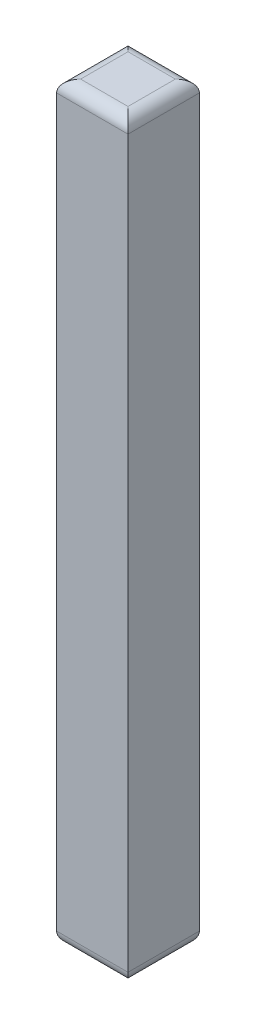
ISO-10303-21;
HEADER;
FILE_DESCRIPTION(('STEP AP214'),'2;1');
FILE_NAME('part.step','',(''),(''),'','','');
FILE_SCHEMA(('AUTOMOTIVE_DESIGN { 1 0 10303 214 1 1 1 1 }'));
ENDSEC;
DATA;
#1=APPLICATION_CONTEXT('core data for automotive mechanical design processes');
#2=APPLICATION_PROTOCOL_DEFINITION('international standard','automotive_design',2000,#1);
#3=PRODUCT_CONTEXT('',#1,'mechanical');
#4=PRODUCT('Part','Part','',(#3));
#5=PRODUCT_RELATED_PRODUCT_CATEGORY('part','',(#4));
#6=PRODUCT_DEFINITION_FORMATION('','',#4);
#7=PRODUCT_DEFINITION_CONTEXT('part definition',#1,'design');
#8=PRODUCT_DEFINITION('design','',#6,#7);
#9=PRODUCT_DEFINITION_SHAPE('','',#8);
#10=(LENGTH_UNIT() NAMED_UNIT(*) SI_UNIT(.MILLI.,.METRE.));
#11=(NAMED_UNIT(*) PLANE_ANGLE_UNIT() SI_UNIT($,.RADIAN.));
#12=(NAMED_UNIT(*) SI_UNIT($,.STERADIAN.) SOLID_ANGLE_UNIT());
#13=UNCERTAINTY_MEASURE_WITH_UNIT(LENGTH_MEASURE(1.E-05),#10,'distance_accuracy_value','');
#14=(GEOMETRIC_REPRESENTATION_CONTEXT(3) GLOBAL_UNCERTAINTY_ASSIGNED_CONTEXT((#13)) GLOBAL_UNIT_ASSIGNED_CONTEXT((#10,
#11,#12)) REPRESENTATION_CONTEXT('',''));
#15=CARTESIAN_POINT('',(0.,0.,0.));
#16=DIRECTION('',(0.,0.,1.));
#17=DIRECTION('',(1.,0.,0.));
#18=AXIS2_PLACEMENT_3D('',#15,#16,#17);
#19=CARTESIAN_POINT('',(0.,31.75,0.));
#20=DIRECTION('',(1.,0.,0.));
#21=DIRECTION('',(0.,0.,-1.));
#22=AXIS2_PLACEMENT_3D('',#19,#20,#21);
#23=PLANE('',#22);
#24=DIRECTION('',(0.,-1.,0.));
#25=VECTOR('',#24,1.);
#26=CARTESIAN_POINT('',(0.,31.75,0.));
#27=LINE('',#26,#25);
#28=CARTESIAN_POINT('',(0.,31.242,0.));
#29=VERTEX_POINT('',#28);
#30=CARTESIAN_POINT('',(0.,0.508000000000002,0.));
#31=VERTEX_POINT('',#30);
#32=EDGE_CURVE('E118',#29,#31,#27,.T.);
#33=ORIENTED_EDGE('',*,*,#32,.F.);
#34=DIRECTION('',(0.,0.,1.));
#35=VECTOR('',#34,1.);
#36=CARTESIAN_POINT('',(0.,31.242,0.));
#37=LINE('',#36,#35);
#38=CARTESIAN_POINT('',(0.,31.242,-3.0226));
#39=VERTEX_POINT('',#38);
#40=EDGE_CURVE('E142',#29,#39,#37,.F.);
#41=ORIENTED_EDGE('',*,*,#40,.T.);
#42=DIRECTION('',(0.,-1.,0.));
#43=VECTOR('',#42,1.);
#44=CARTESIAN_POINT('',(0.,31.75,-3.0226));
#45=LINE('',#44,#43);
#46=CARTESIAN_POINT('',(0.,0.508000000000002,-3.0226));
#47=VERTEX_POINT('',#46);
#48=EDGE_CURVE('E153',#39,#47,#45,.T.);
#49=ORIENTED_EDGE('',*,*,#48,.T.);
#50=DIRECTION('',(0.,0.,1.));
#51=VECTOR('',#50,1.);
#52=CARTESIAN_POINT('',(0.,0.508000000000002,0.));
#53=LINE('',#52,#51);
#54=EDGE_CURVE('E140',#47,#31,#53,.T.);
#55=ORIENTED_EDGE('',*,*,#54,.T.);
#56=EDGE_LOOP('',(#33,#41,#49,#55));
#57=FACE_BOUND('',#56,.T.);
#58=ADVANCED_FACE('F33',(#57),#23,.F.);
#59=CARTESIAN_POINT('',(0.,31.75,0.));
#60=DIRECTION('',(0.,0.,-1.));
#61=DIRECTION('',(-1.,0.,0.));
#62=AXIS2_PLACEMENT_3D('',#59,#60,#61);
#63=PLANE('',#62);
#64=DIRECTION('',(0.,-1.,0.));
#65=VECTOR('',#64,1.);
#66=CARTESIAN_POINT('',(3.0226,31.75,0.));
#67=LINE('',#66,#65);
#68=CARTESIAN_POINT('',(3.0226,31.242,0.));
#69=VERTEX_POINT('',#68);
#70=CARTESIAN_POINT('',(3.0226,0.508000000000002,0.));
#71=VERTEX_POINT('',#70);
#72=EDGE_CURVE('E280',#69,#71,#67,.T.);
#73=ORIENTED_EDGE('',*,*,#72,.F.);
#74=DIRECTION('',(1.,0.,0.));
#75=VECTOR('',#74,1.);
#76=CARTESIAN_POINT('',(0.,31.242,0.));
#77=LINE('',#76,#75);
#78=EDGE_CURVE('E138',#69,#29,#77,.F.);
#79=ORIENTED_EDGE('',*,*,#78,.T.);
#80=ORIENTED_EDGE('',*,*,#32,.T.);
#81=DIRECTION('',(1.,0.,0.));
#82=VECTOR('',#81,1.);
#83=CARTESIAN_POINT('',(3.0226,0.508000000000002,0.));
#84=LINE('',#83,#82);
#85=EDGE_CURVE('E135',#31,#71,#84,.T.);
#86=ORIENTED_EDGE('',*,*,#85,.T.);
#87=EDGE_LOOP('',(#73,#79,#80,#86));
#88=FACE_BOUND('',#87,.T.);
#89=ADVANCED_FACE('F190',(#88),#63,.F.);
#90=CARTESIAN_POINT('',(3.0226,31.75,0.));
#91=DIRECTION('',(-1.,0.,0.));
#92=DIRECTION('',(0.,0.,1.));
#93=AXIS2_PLACEMENT_3D('',#90,#91,#92);
#94=PLANE('',#93);
#95=DIRECTION('',(0.,-1.,0.));
#96=VECTOR('',#95,1.);
#97=CARTESIAN_POINT('',(3.0226,31.75,-3.0226));
#98=LINE('',#97,#96);
#99=CARTESIAN_POINT('',(3.0226,31.242,-3.0226));
#100=VERTEX_POINT('',#99);
#101=CARTESIAN_POINT('',(3.0226,0.508000000000002,-3.0226));
#102=VERTEX_POINT('',#101);
#103=EDGE_CURVE('E276',#100,#102,#98,.T.);
#104=ORIENTED_EDGE('',*,*,#103,.F.);
#105=DIRECTION('',(0.,0.,-1.));
#106=VECTOR('',#105,1.);
#107=CARTESIAN_POINT('',(3.0226,31.242,0.));
#108=LINE('',#107,#106);
#109=EDGE_CURVE('E133',#100,#69,#108,.F.);
#110=ORIENTED_EDGE('',*,*,#109,.T.);
#111=ORIENTED_EDGE('',*,*,#72,.T.);
#112=DIRECTION('',(0.,0.,-1.));
#113=VECTOR('',#112,1.);
#114=CARTESIAN_POINT('',(3.0226,0.508000000000002,-3.0226));
#115=LINE('',#114,#113);
#116=EDGE_CURVE('E131',#71,#102,#115,.T.);
#117=ORIENTED_EDGE('',*,*,#116,.T.);
#118=EDGE_LOOP('',(#104,#110,#111,#117));
#119=FACE_BOUND('',#118,.T.);
#120=ADVANCED_FACE('F196',(#119),#94,.F.);
#121=CARTESIAN_POINT('',(0.,31.75,-3.0226));
#122=DIRECTION('',(0.,0.,1.));
#123=DIRECTION('',(1.,0.,0.));
#124=AXIS2_PLACEMENT_3D('',#121,#122,#123);
#125=PLANE('',#124);
#126=ORIENTED_EDGE('',*,*,#48,.F.);
#127=DIRECTION('',(-1.,0.,0.));
#128=VECTOR('',#127,1.);
#129=CARTESIAN_POINT('',(0.,31.242,-3.0226));
#130=LINE('',#129,#128);
#131=EDGE_CURVE('E105',#39,#100,#130,.F.);
#132=ORIENTED_EDGE('',*,*,#131,.T.);
#133=ORIENTED_EDGE('',*,*,#103,.T.);
#134=DIRECTION('',(-1.,0.,0.));
#135=VECTOR('',#134,1.);
#136=CARTESIAN_POINT('',(0.,0.508000000000002,-3.0226));
#137=LINE('',#136,#135);
#138=EDGE_CURVE('E124',#102,#47,#137,.T.);
#139=ORIENTED_EDGE('',*,*,#138,.T.);
#140=EDGE_LOOP('',(#126,#132,#133,#139));
#141=FACE_BOUND('',#140,.T.);
#142=ADVANCED_FACE('F186',(#141),#125,.F.);
#143=CARTESIAN_POINT('',(0.,31.75,0.));
#144=DIRECTION('',(0.,-1.,0.));
#145=DIRECTION('',(0.,0.,-1.));
#146=AXIS2_PLACEMENT_3D('',#143,#144,#145);
#147=PLANE('',#146);
#148=DIRECTION('',(0.,0.,-1.));
#149=VECTOR('',#148,1.);
#150=CARTESIAN_POINT('',(2.5146,31.75,0.));
#151=LINE('',#150,#149);
#152=CARTESIAN_POINT('',(2.5146,31.75,-0.508));
#153=VERTEX_POINT('',#152);
#154=CARTESIAN_POINT('',(2.5146,31.75,-2.5146));
#155=VERTEX_POINT('',#154);
#156=EDGE_CURVE('E122',#153,#155,#151,.T.);
#157=ORIENTED_EDGE('',*,*,#156,.T.);
#158=DIRECTION('',(-1.,0.,0.));
#159=VECTOR('',#158,1.);
#160=CARTESIAN_POINT('',(0.,31.75,-2.5146));
#161=LINE('',#160,#159);
#162=CARTESIAN_POINT('',(0.508,31.75,-2.5146));
#163=VERTEX_POINT('',#162);
#164=EDGE_CURVE('E103',#155,#163,#161,.T.);
#165=ORIENTED_EDGE('',*,*,#164,.T.);
#166=DIRECTION('',(0.,0.,1.));
#167=VECTOR('',#166,1.);
#168=CARTESIAN_POINT('',(0.508,31.75,0.));
#169=LINE('',#168,#167);
#170=CARTESIAN_POINT('',(0.508,31.75,-0.508));
#171=VERTEX_POINT('',#170);
#172=EDGE_CURVE('E111',#163,#171,#169,.T.);
#173=ORIENTED_EDGE('',*,*,#172,.T.);
#174=DIRECTION('',(1.,0.,0.));
#175=VECTOR('',#174,1.);
#176=CARTESIAN_POINT('',(0.,31.75,-0.508));
#177=LINE('',#176,#175);
#178=EDGE_CURVE('E117',#171,#153,#177,.T.);
#179=ORIENTED_EDGE('',*,*,#178,.T.);
#180=EDGE_LOOP('',(#157,#165,#173,#179));
#181=FACE_BOUND('',#180,.T.);
#182=ADVANCED_FACE('F120',(#181),#147,.F.);
#183=CARTESIAN_POINT('',(0.,0.,0.));
#184=DIRECTION('',(0.,-1.,0.));
#185=DIRECTION('',(0.,0.,-1.));
#186=AXIS2_PLACEMENT_3D('',#183,#184,#185);
#187=PLANE('',#186);
#188=DIRECTION('',(0.,0.,-1.));
#189=VECTOR('',#188,1.);
#190=CARTESIAN_POINT('',(2.5146,0.,0.));
#191=LINE('',#190,#189);
#192=CARTESIAN_POINT('',(2.5146,0.,-2.5146));
#193=VERTEX_POINT('',#192);
#194=CARTESIAN_POINT('',(2.5146,0.,-0.508));
#195=VERTEX_POINT('',#194);
#196=EDGE_CURVE('E42',#193,#195,#191,.F.);
#197=ORIENTED_EDGE('',*,*,#196,.T.);
#198=DIRECTION('',(1.,0.,0.));
#199=VECTOR('',#198,1.);
#200=CARTESIAN_POINT('',(0.,0.,-0.508));
#201=LINE('',#200,#199);
#202=CARTESIAN_POINT('',(0.508,0.,-0.508));
#203=VERTEX_POINT('',#202);
#204=EDGE_CURVE('E11',#195,#203,#201,.F.);
#205=ORIENTED_EDGE('',*,*,#204,.T.);
#206=DIRECTION('',(0.,0.,1.));
#207=VECTOR('',#206,1.);
#208=CARTESIAN_POINT('',(0.508,0.,-3.0226));
#209=LINE('',#208,#207);
#210=CARTESIAN_POINT('',(0.508,0.,-2.5146));
#211=VERTEX_POINT('',#210);
#212=EDGE_CURVE('E144',#203,#211,#209,.F.);
#213=ORIENTED_EDGE('',*,*,#212,.T.);
#214=DIRECTION('',(-1.,0.,0.));
#215=VECTOR('',#214,1.);
#216=CARTESIAN_POINT('',(3.0226,0.,-2.5146));
#217=LINE('',#216,#215);
#218=EDGE_CURVE('E53',#211,#193,#217,.F.);
#219=ORIENTED_EDGE('',*,*,#218,.T.);
#220=EDGE_LOOP('',(#197,#205,#213,#219));
#221=FACE_BOUND('',#220,.T.);
#222=ADVANCED_FACE('F175',(#221),#187,.T.);
#223=CARTESIAN_POINT('',(0.,31.242,-0.508));
#224=DIRECTION('',(1.,0.,0.));
#225=DIRECTION('',(0.,0.,-1.));
#226=AXIS2_PLACEMENT_3D('',#223,#224,#225);
#227=CYLINDRICAL_SURFACE('',#226,0.508);
#228=CARTESIAN_POINT('',(0.508,31.242,-0.508));
#229=DIRECTION('',(0.707106781186547,0.,0.707106781186547));
#230=DIRECTION('',(-0.707106781186547,0.,0.707106781186547));
#231=AXIS2_PLACEMENT_3D('',#228,#229,#230);
#232=ELLIPSE('',#231,0.718420489685532,0.508);
#233=EDGE_CURVE('E114',#29,#171,#232,.F.);
#234=ORIENTED_EDGE('',*,*,#233,.F.);
#235=ORIENTED_EDGE('',*,*,#78,.F.);
#236=CARTESIAN_POINT('',(2.5146,31.242,-0.508));
#237=DIRECTION('',(0.707106781186547,0.,-0.707106781186548));
#238=DIRECTION('',(0.707106781186548,0.,0.707106781186547));
#239=AXIS2_PLACEMENT_3D('',#236,#237,#238);
#240=ELLIPSE('',#239,0.718420489685532,0.508);
#241=EDGE_CURVE('E150',#153,#69,#240,.T.);
#242=ORIENTED_EDGE('',*,*,#241,.F.);
#243=ORIENTED_EDGE('',*,*,#178,.F.);
#244=EDGE_LOOP('',(#234,#235,#242,#243));
#245=FACE_BOUND('',#244,.T.);
#246=ADVANCED_FACE('F177',(#245),#227,.T.);
#247=CARTESIAN_POINT('',(2.5146,31.242,0.));
#248=DIRECTION('',(0.,0.,-1.));
#249=DIRECTION('',(-1.,0.,0.));
#250=AXIS2_PLACEMENT_3D('',#247,#248,#249);
#251=CYLINDRICAL_SURFACE('',#250,0.508);
#252=ORIENTED_EDGE('',*,*,#241,.T.);
#253=ORIENTED_EDGE('',*,*,#109,.F.);
#254=CARTESIAN_POINT('',(2.5146,31.242,-2.5146));
#255=DIRECTION('',(-0.707106781186548,0.,-0.707106781186547));
#256=DIRECTION('',(0.707106781186547,0.,-0.707106781186548));
#257=AXIS2_PLACEMENT_3D('',#254,#255,#256);
#258=ELLIPSE('',#257,0.718420489685532,0.508);
#259=EDGE_CURVE('E108',#155,#100,#258,.T.);
#260=ORIENTED_EDGE('',*,*,#259,.F.);
#261=ORIENTED_EDGE('',*,*,#156,.F.);
#262=EDGE_LOOP('',(#252,#253,#260,#261));
#263=FACE_BOUND('',#262,.T.);
#264=ADVANCED_FACE('F183',(#263),#251,.T.);
#265=CARTESIAN_POINT('',(0.508,31.242,0.));
#266=DIRECTION('',(0.,0.,1.));
#267=DIRECTION('',(1.,0.,0.));
#268=AXIS2_PLACEMENT_3D('',#265,#266,#267);
#269=CYLINDRICAL_SURFACE('',#268,0.508);
#270=ORIENTED_EDGE('',*,*,#233,.T.);
#271=ORIENTED_EDGE('',*,*,#172,.F.);
#272=CARTESIAN_POINT('',(0.508,31.242,-2.5146));
#273=DIRECTION('',(-0.707106781186547,0.,0.707106781186547));
#274=DIRECTION('',(0.707106781186547,0.,0.707106781186547));
#275=AXIS2_PLACEMENT_3D('',#272,#273,#274);
#276=ELLIPSE('',#275,0.718420489685532,0.508);
#277=EDGE_CURVE('E99',#39,#163,#276,.F.);
#278=ORIENTED_EDGE('',*,*,#277,.F.);
#279=ORIENTED_EDGE('',*,*,#40,.F.);
#280=EDGE_LOOP('',(#270,#271,#278,#279));
#281=FACE_BOUND('',#280,.T.);
#282=ADVANCED_FACE('F112',(#281),#269,.T.);
#283=CARTESIAN_POINT('',(0.,31.242,-2.5146));
#284=DIRECTION('',(-1.,0.,0.));
#285=DIRECTION('',(0.,0.,1.));
#286=AXIS2_PLACEMENT_3D('',#283,#284,#285);
#287=CYLINDRICAL_SURFACE('',#286,0.508);
#288=ORIENTED_EDGE('',*,*,#259,.T.);
#289=ORIENTED_EDGE('',*,*,#131,.F.);
#290=ORIENTED_EDGE('',*,*,#277,.T.);
#291=ORIENTED_EDGE('',*,*,#164,.F.);
#292=EDGE_LOOP('',(#288,#289,#290,#291));
#293=FACE_BOUND('',#292,.T.);
#294=ADVANCED_FACE('F101',(#293),#287,.T.);
#295=CARTESIAN_POINT('',(0.,0.508000000000002,-2.5146));
#296=DIRECTION('',(1.,0.,0.));
#297=DIRECTION('',(0.,0.,-1.));
#298=AXIS2_PLACEMENT_3D('',#295,#296,#297);
#299=CYLINDRICAL_SURFACE('',#298,0.508);
#300=CARTESIAN_POINT('',(2.5146,0.508000000000002,-2.5146));
#301=DIRECTION('',(0.707106781186548,0.,0.707106781186547));
#302=DIRECTION('',(0.707106781186547,0.,-0.707106781186548));
#303=AXIS2_PLACEMENT_3D('',#300,#301,#302);
#304=ELLIPSE('',#303,0.718420489685532,0.508);
#305=EDGE_CURVE('E157',#193,#102,#304,.T.);
#306=ORIENTED_EDGE('',*,*,#305,.F.);
#307=ORIENTED_EDGE('',*,*,#218,.F.);
#308=CARTESIAN_POINT('',(0.508,0.508000000000002,-2.5146));
#309=DIRECTION('',(0.707106781186547,0.,-0.707106781186547));
#310=DIRECTION('',(-0.707106781186547,0.,-0.707106781186547));
#311=AXIS2_PLACEMENT_3D('',#308,#309,#310);
#312=ELLIPSE('',#311,0.718420489685532,0.508);
#313=EDGE_CURVE('E37',#47,#211,#312,.F.);
#314=ORIENTED_EDGE('',*,*,#313,.F.);
#315=ORIENTED_EDGE('',*,*,#138,.F.);
#316=EDGE_LOOP('',(#306,#307,#314,#315));
#317=FACE_BOUND('',#316,.T.);
#318=ADVANCED_FACE('F35',(#317),#299,.T.);
#319=CARTESIAN_POINT('',(0.508,0.508000000000002,0.));
#320=DIRECTION('',(0.,0.,-1.));
#321=DIRECTION('',(-1.,0.,0.));
#322=AXIS2_PLACEMENT_3D('',#319,#320,#321);
#323=CYLINDRICAL_SURFACE('',#322,0.508);
#324=ORIENTED_EDGE('',*,*,#313,.T.);
#325=ORIENTED_EDGE('',*,*,#212,.F.);
#326=CARTESIAN_POINT('',(0.508,0.508000000000002,-0.508));
#327=DIRECTION('',(-0.707106781186547,0.,-0.707106781186547));
#328=DIRECTION('',(0.707106781186547,0.,-0.707106781186547));
#329=AXIS2_PLACEMENT_3D('',#326,#327,#328);
#330=ELLIPSE('',#329,0.718420489685532,0.508);
#331=EDGE_CURVE('E156',#31,#203,#330,.F.);
#332=ORIENTED_EDGE('',*,*,#331,.F.);
#333=ORIENTED_EDGE('',*,*,#54,.F.);
#334=EDGE_LOOP('',(#324,#325,#332,#333));
#335=FACE_BOUND('',#334,.T.);
#336=ADVANCED_FACE('F166',(#335),#323,.T.);
#337=CARTESIAN_POINT('',(2.5146,0.508000000000002,0.));
#338=DIRECTION('',(0.,0.,1.));
#339=DIRECTION('',(1.,0.,0.));
#340=AXIS2_PLACEMENT_3D('',#337,#338,#339);
#341=CYLINDRICAL_SURFACE('',#340,0.508);
#342=ORIENTED_EDGE('',*,*,#305,.T.);
#343=ORIENTED_EDGE('',*,*,#116,.F.);
#344=CARTESIAN_POINT('',(2.5146,0.508000000000002,-0.508));
#345=DIRECTION('',(-0.707106781186547,0.,0.707106781186548));
#346=DIRECTION('',(0.707106781186548,0.,0.707106781186547));
#347=AXIS2_PLACEMENT_3D('',#344,#345,#346);
#348=ELLIPSE('',#347,0.718420489685532,0.508);
#349=EDGE_CURVE('E154',#195,#71,#348,.T.);
#350=ORIENTED_EDGE('',*,*,#349,.F.);
#351=ORIENTED_EDGE('',*,*,#196,.F.);
#352=EDGE_LOOP('',(#342,#343,#350,#351));
#353=FACE_BOUND('',#352,.T.);
#354=ADVANCED_FACE('F171',(#353),#341,.T.);
#355=CARTESIAN_POINT('',(0.,0.508000000000002,-0.508));
#356=DIRECTION('',(-1.,0.,0.));
#357=DIRECTION('',(0.,0.,1.));
#358=AXIS2_PLACEMENT_3D('',#355,#356,#357);
#359=CYLINDRICAL_SURFACE('',#358,0.508);
#360=ORIENTED_EDGE('',*,*,#331,.T.);
#361=ORIENTED_EDGE('',*,*,#204,.F.);
#362=ORIENTED_EDGE('',*,*,#349,.T.);
#363=ORIENTED_EDGE('',*,*,#85,.F.);
#364=EDGE_LOOP('',(#360,#361,#362,#363));
#365=FACE_BOUND('',#364,.T.);
#366=ADVANCED_FACE('F174',(#365),#359,.T.);
#367=CLOSED_SHELL('',(#58,#89,#120,#142,#182,#222,#246,#264,#282,#294,#318,#336,#354,#366));
#368=MANIFOLD_SOLID_BREP('B2',#367);
#369=ADVANCED_BREP_SHAPE_REPRESENTATION('',(#18,#368),#14);
#370=SHAPE_DEFINITION_REPRESENTATION(#9,#369);
ENDSEC;
END-ISO-10303-21;
